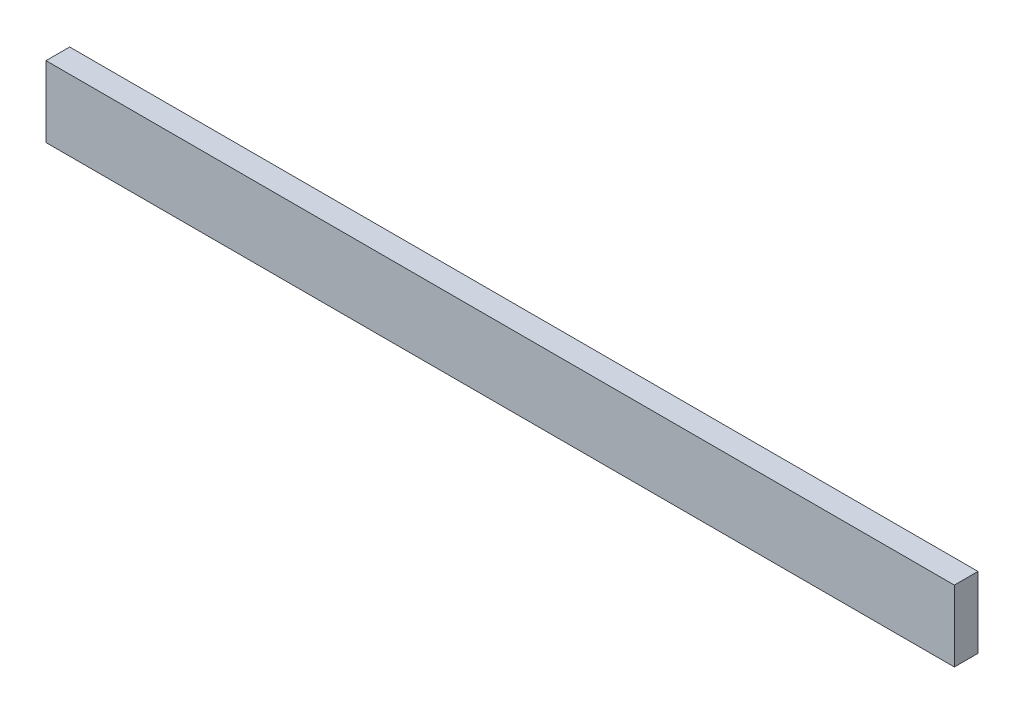
ISO-10303-21;
HEADER;
FILE_DESCRIPTION(('STEP AP214'),'2;1');
FILE_NAME('part.step','',(''),(''),'','','');
FILE_SCHEMA(('AUTOMOTIVE_DESIGN { 1 0 10303 214 1 1 1 1 }'));
ENDSEC;
DATA;
#1=APPLICATION_CONTEXT('core data for automotive mechanical design processes');
#2=APPLICATION_PROTOCOL_DEFINITION('international standard','automotive_design',2000,#1);
#3=PRODUCT_CONTEXT('',#1,'mechanical');
#4=PRODUCT('Part','Part','',(#3));
#5=PRODUCT_RELATED_PRODUCT_CATEGORY('part','',(#4));
#6=PRODUCT_DEFINITION_FORMATION('','',#4);
#7=PRODUCT_DEFINITION_CONTEXT('part definition',#1,'design');
#8=PRODUCT_DEFINITION('design','',#6,#7);
#9=PRODUCT_DEFINITION_SHAPE('','',#8);
#10=(LENGTH_UNIT() NAMED_UNIT(*) SI_UNIT(.MILLI.,.METRE.));
#11=(NAMED_UNIT(*) PLANE_ANGLE_UNIT() SI_UNIT($,.RADIAN.));
#12=(NAMED_UNIT(*) SI_UNIT($,.STERADIAN.) SOLID_ANGLE_UNIT());
#13=UNCERTAINTY_MEASURE_WITH_UNIT(LENGTH_MEASURE(1.E-05),#10,'distance_accuracy_value','');
#14=(GEOMETRIC_REPRESENTATION_CONTEXT(3) GLOBAL_UNCERTAINTY_ASSIGNED_CONTEXT((#13)) GLOBAL_UNIT_ASSIGNED_CONTEXT((#10,
#11,#12)) REPRESENTATION_CONTEXT('',''));
#15=CARTESIAN_POINT('',(0.,0.,0.));
#16=DIRECTION('',(0.,0.,1.));
#17=DIRECTION('',(1.,0.,0.));
#18=AXIS2_PLACEMENT_3D('',#15,#16,#17);
#19=CARTESIAN_POINT('',(0.,0.,6.35));
#20=DIRECTION('',(1.,0.,0.));
#21=DIRECTION('',(0.,0.,-1.));
#22=AXIS2_PLACEMENT_3D('',#19,#20,#21);
#23=PLANE('',#22);
#24=DIRECTION('',(0.,-1.,0.));
#25=VECTOR('',#24,1.);
#26=CARTESIAN_POINT('',(0.,0.,0.));
#27=LINE('',#26,#25);
#28=CARTESIAN_POINT('',(0.,19.05,0.));
#29=VERTEX_POINT('',#28);
#30=CARTESIAN_POINT('',(0.,0.,0.));
#31=VERTEX_POINT('',#30);
#32=EDGE_CURVE('E128',#29,#31,#27,.T.);
#33=ORIENTED_EDGE('',*,*,#32,.T.);
#34=DIRECTION('',(0.,0.,-1.));
#35=VECTOR('',#34,1.);
#36=CARTESIAN_POINT('',(0.,0.,6.35));
#37=LINE('',#36,#35);
#38=CARTESIAN_POINT('',(0.,0.,6.35));
#39=VERTEX_POINT('',#38);
#40=EDGE_CURVE('E12',#39,#31,#37,.T.);
#41=ORIENTED_EDGE('',*,*,#40,.F.);
#42=DIRECTION('',(0.,-1.,0.));
#43=VECTOR('',#42,1.);
#44=CARTESIAN_POINT('',(0.,0.,6.35));
#45=LINE('',#44,#43);
#46=CARTESIAN_POINT('',(0.,19.05,6.35));
#47=VERTEX_POINT('',#46);
#48=EDGE_CURVE('E92',#47,#39,#45,.T.);
#49=ORIENTED_EDGE('',*,*,#48,.F.);
#50=DIRECTION('',(0.,0.,-1.));
#51=VECTOR('',#50,1.);
#52=CARTESIAN_POINT('',(0.,19.05,6.35));
#53=LINE('',#52,#51);
#54=EDGE_CURVE('E104',#47,#29,#53,.T.);
#55=ORIENTED_EDGE('',*,*,#54,.T.);
#56=EDGE_LOOP('',(#33,#41,#49,#55));
#57=FACE_BOUND('',#56,.T.);
#58=ADVANCED_FACE('F40',(#57),#23,.F.);
#59=CARTESIAN_POINT('',(0.,0.,6.35));
#60=DIRECTION('',(0.,1.,0.));
#61=DIRECTION('',(0.,0.,1.));
#62=AXIS2_PLACEMENT_3D('',#59,#60,#61);
#63=PLANE('',#62);
#64=DIRECTION('',(1.,0.,0.));
#65=VECTOR('',#64,1.);
#66=CARTESIAN_POINT('',(0.,0.,0.));
#67=LINE('',#66,#65);
#68=CARTESIAN_POINT('',(243.84,0.,0.));
#69=VERTEX_POINT('',#68);
#70=EDGE_CURVE('E97',#31,#69,#67,.T.);
#71=ORIENTED_EDGE('',*,*,#70,.T.);
#72=DIRECTION('',(0.,0.,-1.));
#73=VECTOR('',#72,1.);
#74=CARTESIAN_POINT('',(243.84,0.,6.35));
#75=LINE('',#74,#73);
#76=CARTESIAN_POINT('',(243.84,0.,6.35));
#77=VERTEX_POINT('',#76);
#78=EDGE_CURVE('E49',#77,#69,#75,.T.);
#79=ORIENTED_EDGE('',*,*,#78,.F.);
#80=DIRECTION('',(1.,0.,0.));
#81=VECTOR('',#80,1.);
#82=CARTESIAN_POINT('',(0.,0.,6.35));
#83=LINE('',#82,#81);
#84=EDGE_CURVE('E87',#39,#77,#83,.T.);
#85=ORIENTED_EDGE('',*,*,#84,.F.);
#86=ORIENTED_EDGE('',*,*,#40,.T.);
#87=EDGE_LOOP('',(#71,#79,#85,#86));
#88=FACE_BOUND('',#87,.T.);
#89=ADVANCED_FACE('F96',(#88),#63,.F.);
#90=CARTESIAN_POINT('',(243.84,0.,6.35));
#91=DIRECTION('',(-1.,0.,0.));
#92=DIRECTION('',(0.,0.,1.));
#93=AXIS2_PLACEMENT_3D('',#90,#91,#92);
#94=PLANE('',#93);
#95=DIRECTION('',(0.,1.,0.));
#96=VECTOR('',#95,1.);
#97=CARTESIAN_POINT('',(243.84,0.,0.));
#98=LINE('',#97,#96);
#99=CARTESIAN_POINT('',(243.84,19.05,0.));
#100=VERTEX_POINT('',#99);
#101=EDGE_CURVE('E74',#69,#100,#98,.T.);
#102=ORIENTED_EDGE('',*,*,#101,.T.);
#103=DIRECTION('',(0.,0.,-1.));
#104=VECTOR('',#103,1.);
#105=CARTESIAN_POINT('',(243.84,19.05,6.35));
#106=LINE('',#105,#104);
#107=CARTESIAN_POINT('',(243.84,19.05,6.35));
#108=VERTEX_POINT('',#107);
#109=EDGE_CURVE('E99',#108,#100,#106,.T.);
#110=ORIENTED_EDGE('',*,*,#109,.F.);
#111=DIRECTION('',(0.,1.,0.));
#112=VECTOR('',#111,1.);
#113=CARTESIAN_POINT('',(243.84,0.,6.35));
#114=LINE('',#113,#112);
#115=EDGE_CURVE('E90',#77,#108,#114,.T.);
#116=ORIENTED_EDGE('',*,*,#115,.F.);
#117=ORIENTED_EDGE('',*,*,#78,.T.);
#118=EDGE_LOOP('',(#102,#110,#116,#117));
#119=FACE_BOUND('',#118,.T.);
#120=ADVANCED_FACE('F100',(#119),#94,.F.);
#121=CARTESIAN_POINT('',(0.,19.05,6.35));
#122=DIRECTION('',(0.,-1.,0.));
#123=DIRECTION('',(1.,0.,0.));
#124=AXIS2_PLACEMENT_3D('',#121,#122,#123);
#125=PLANE('',#124);
#126=DIRECTION('',(-1.,0.,0.));
#127=VECTOR('',#126,1.);
#128=CARTESIAN_POINT('',(0.,19.05,0.));
#129=LINE('',#128,#127);
#130=EDGE_CURVE('E80',#100,#29,#129,.T.);
#131=ORIENTED_EDGE('',*,*,#130,.T.);
#132=ORIENTED_EDGE('',*,*,#54,.F.);
#133=DIRECTION('',(-1.,0.,0.));
#134=VECTOR('',#133,1.);
#135=CARTESIAN_POINT('',(0.,19.05,6.35));
#136=LINE('',#135,#134);
#137=EDGE_CURVE('E57',#108,#47,#136,.T.);
#138=ORIENTED_EDGE('',*,*,#137,.F.);
#139=ORIENTED_EDGE('',*,*,#109,.T.);
#140=EDGE_LOOP('',(#131,#132,#138,#139));
#141=FACE_BOUND('',#140,.T.);
#142=ADVANCED_FACE('F123',(#141),#125,.F.);
#143=CARTESIAN_POINT('',(0.,0.,6.35));
#144=DIRECTION('',(0.,0.,-1.));
#145=DIRECTION('',(-1.,0.,0.));
#146=AXIS2_PLACEMENT_3D('',#143,#144,#145);
#147=PLANE('',#146);
#148=ORIENTED_EDGE('',*,*,#48,.T.);
#149=ORIENTED_EDGE('',*,*,#84,.T.);
#150=ORIENTED_EDGE('',*,*,#115,.T.);
#151=ORIENTED_EDGE('',*,*,#137,.T.);
#152=EDGE_LOOP('',(#148,#149,#150,#151));
#153=FACE_BOUND('',#152,.T.);
#154=ADVANCED_FACE('F88',(#153),#147,.F.);
#155=CARTESIAN_POINT('',(0.,0.,0.));
#156=DIRECTION('',(0.,0.,-1.));
#157=DIRECTION('',(-1.,0.,0.));
#158=AXIS2_PLACEMENT_3D('',#155,#156,#157);
#159=PLANE('',#158);
#160=ORIENTED_EDGE('',*,*,#32,.F.);
#161=ORIENTED_EDGE('',*,*,#130,.F.);
#162=ORIENTED_EDGE('',*,*,#101,.F.);
#163=ORIENTED_EDGE('',*,*,#70,.F.);
#164=EDGE_LOOP('',(#160,#161,#162,#163));
#165=FACE_BOUND('',#164,.T.);
#166=ADVANCED_FACE('F126',(#165),#159,.T.);
#167=CLOSED_SHELL('',(#58,#89,#120,#142,#154,#166));
#168=MANIFOLD_SOLID_BREP('B2',#167);
#169=ADVANCED_BREP_SHAPE_REPRESENTATION('',(#18,#168),#14);
#170=SHAPE_DEFINITION_REPRESENTATION(#9,#169);
ENDSEC;
END-ISO-10303-21;
